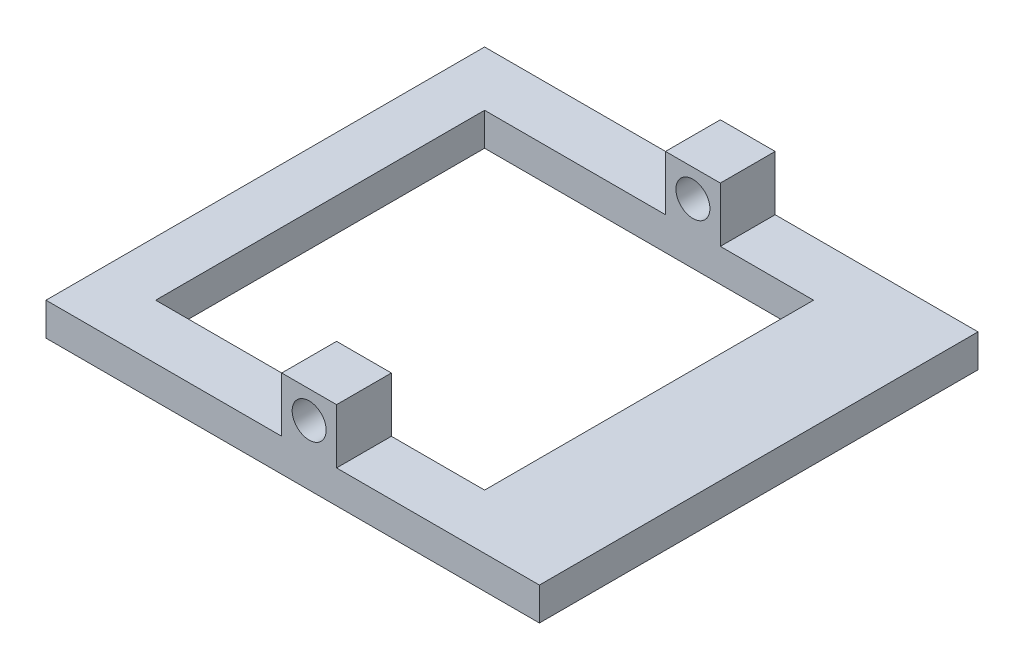
ISO-10303-21;
HEADER;
FILE_DESCRIPTION(('STEP AP214'),'2;1');
FILE_NAME('part.step','',(''),(''),'','','');
FILE_SCHEMA(('AUTOMOTIVE_DESIGN { 1 0 10303 214 1 1 1 1 }'));
ENDSEC;
DATA;
#1=APPLICATION_CONTEXT('core data for automotive mechanical design processes');
#2=APPLICATION_PROTOCOL_DEFINITION('international standard','automotive_design',2000,#1);
#3=PRODUCT_CONTEXT('',#1,'mechanical');
#4=PRODUCT('Part','Part','',(#3));
#5=PRODUCT_RELATED_PRODUCT_CATEGORY('part','',(#4));
#6=PRODUCT_DEFINITION_FORMATION('','',#4);
#7=PRODUCT_DEFINITION_CONTEXT('part definition',#1,'design');
#8=PRODUCT_DEFINITION('design','',#6,#7);
#9=PRODUCT_DEFINITION_SHAPE('','',#8);
#10=(LENGTH_UNIT() NAMED_UNIT(*) SI_UNIT(.MILLI.,.METRE.));
#11=(NAMED_UNIT(*) PLANE_ANGLE_UNIT() SI_UNIT($,.RADIAN.));
#12=(NAMED_UNIT(*) SI_UNIT($,.STERADIAN.) SOLID_ANGLE_UNIT());
#13=UNCERTAINTY_MEASURE_WITH_UNIT(LENGTH_MEASURE(1.E-05),#10,'distance_accuracy_value','');
#14=(GEOMETRIC_REPRESENTATION_CONTEXT(3) GLOBAL_UNCERTAINTY_ASSIGNED_CONTEXT((#13)) GLOBAL_UNIT_ASSIGNED_CONTEXT((#10,
#11,#12)) REPRESENTATION_CONTEXT('',''));
#15=CARTESIAN_POINT('',(0.,0.,0.));
#16=DIRECTION('',(0.,0.,1.));
#17=DIRECTION('',(1.,0.,0.));
#18=AXIS2_PLACEMENT_3D('',#15,#16,#17);
#19=CARTESIAN_POINT('',(0.,3.,0.));
#20=DIRECTION('',(0.,1.,0.));
#21=DIRECTION('',(0.,0.,1.));
#22=AXIS2_PLACEMENT_3D('',#19,#20,#21);
#23=PLANE('',#22);
#24=DIRECTION('',(-1.,0.,0.));
#25=VECTOR('',#24,1.);
#26=CARTESIAN_POINT('',(-22.5,3.,-20.));
#27=LINE('',#26,#25);
#28=CARTESIAN_POINT('',(22.5,3.,-20.));
#29=VERTEX_POINT('',#28);
#30=CARTESIAN_POINT('',(4.,3.,-20.));
#31=VERTEX_POINT('',#30);
#32=EDGE_CURVE('E174',#29,#31,#27,.T.);
#33=ORIENTED_EDGE('',*,*,#32,.T.);
#34=DIRECTION('',(0.,0.,-1.));
#35=VECTOR('',#34,1.);
#36=CARTESIAN_POINT('',(4.,3.,-15.));
#37=LINE('',#36,#35);
#38=CARTESIAN_POINT('',(4.,3.,-15.));
#39=VERTEX_POINT('',#38);
#40=EDGE_CURVE('E159',#39,#31,#37,.T.);
#41=ORIENTED_EDGE('',*,*,#40,.F.);
#42=DIRECTION('',(-1.,0.,0.));
#43=VECTOR('',#42,1.);
#44=CARTESIAN_POINT('',(-17.5,3.,-15.));
#45=LINE('',#44,#43);
#46=CARTESIAN_POINT('',(12.5,3.,-15.));
#47=VERTEX_POINT('',#46);
#48=EDGE_CURVE('E172',#47,#39,#45,.T.);
#49=ORIENTED_EDGE('',*,*,#48,.F.);
#50=DIRECTION('',(0.,0.,-1.));
#51=VECTOR('',#50,1.);
#52=CARTESIAN_POINT('',(12.5,3.,-15.));
#53=LINE('',#52,#51);
#54=CARTESIAN_POINT('',(12.5,3.,15.));
#55=VERTEX_POINT('',#54);
#56=EDGE_CURVE('E188',#55,#47,#53,.T.);
#57=ORIENTED_EDGE('',*,*,#56,.F.);
#58=DIRECTION('',(1.,0.,0.));
#59=VECTOR('',#58,1.);
#60=CARTESIAN_POINT('',(-17.5,3.,15.));
#61=LINE('',#60,#59);
#62=CARTESIAN_POINT('',(4.,3.,15.));
#63=VERTEX_POINT('',#62);
#64=EDGE_CURVE('E186',#63,#55,#61,.T.);
#65=ORIENTED_EDGE('',*,*,#64,.F.);
#66=DIRECTION('',(0.,0.,1.));
#67=VECTOR('',#66,1.);
#68=CARTESIAN_POINT('',(4.,3.,15.));
#69=LINE('',#68,#67);
#70=CARTESIAN_POINT('',(4.,3.,20.));
#71=VERTEX_POINT('',#70);
#72=EDGE_CURVE('E256',#63,#71,#69,.T.);
#73=ORIENTED_EDGE('',*,*,#72,.T.);
#74=DIRECTION('',(1.,0.,0.));
#75=VECTOR('',#74,1.);
#76=CARTESIAN_POINT('',(-22.5,3.,20.));
#77=LINE('',#76,#75);
#78=CARTESIAN_POINT('',(22.5,3.,20.));
#79=VERTEX_POINT('',#78);
#80=EDGE_CURVE('E216',#71,#79,#77,.T.);
#81=ORIENTED_EDGE('',*,*,#80,.T.);
#82=DIRECTION('',(0.,0.,-1.));
#83=VECTOR('',#82,1.);
#84=CARTESIAN_POINT('',(22.5,3.,-20.));
#85=LINE('',#84,#83);
#86=EDGE_CURVE('E209',#79,#29,#85,.T.);
#87=ORIENTED_EDGE('',*,*,#86,.T.);
#88=EDGE_LOOP('',(#33,#41,#49,#57,#65,#73,#81,#87));
#89=FACE_BOUND('',#88,.T.);
#90=ADVANCED_FACE('F35',(#89),#23,.T.);
#91=CARTESIAN_POINT('',(-0.999999999999994,3.,-15.));
#92=VERTEX_POINT('',#91);
#93=CARTESIAN_POINT('',(-17.5,3.,-15.));
#94=VERTEX_POINT('',#93);
#95=EDGE_CURVE('E183',#92,#94,#45,.T.);
#96=ORIENTED_EDGE('',*,*,#95,.F.);
#97=DIRECTION('',(0.,0.,-1.));
#98=VECTOR('',#97,1.);
#99=CARTESIAN_POINT('',(-0.999999999999996,3.,-15.));
#100=LINE('',#99,#98);
#101=CARTESIAN_POINT('',(-0.999999999999996,3.,-20.));
#102=VERTEX_POINT('',#101);
#103=EDGE_CURVE('E50',#92,#102,#100,.T.);
#104=ORIENTED_EDGE('',*,*,#103,.T.);
#105=CARTESIAN_POINT('',(-22.5,3.,-20.));
#106=VERTEX_POINT('',#105);
#107=EDGE_CURVE('E211',#102,#106,#27,.T.);
#108=ORIENTED_EDGE('',*,*,#107,.T.);
#109=DIRECTION('',(0.,0.,1.));
#110=VECTOR('',#109,1.);
#111=CARTESIAN_POINT('',(-22.5,3.,-20.));
#112=LINE('',#111,#110);
#113=CARTESIAN_POINT('',(-22.5,3.,20.));
#114=VERTEX_POINT('',#113);
#115=EDGE_CURVE('E214',#106,#114,#112,.T.);
#116=ORIENTED_EDGE('',*,*,#115,.T.);
#117=CARTESIAN_POINT('',(-0.999999999999996,3.,20.));
#118=VERTEX_POINT('',#117);
#119=EDGE_CURVE('E217',#114,#118,#77,.T.);
#120=ORIENTED_EDGE('',*,*,#119,.T.);
#121=DIRECTION('',(0.,0.,1.));
#122=VECTOR('',#121,1.);
#123=CARTESIAN_POINT('',(-0.999999999999996,3.,15.));
#124=LINE('',#123,#122);
#125=CARTESIAN_POINT('',(-0.999999999999996,3.,15.));
#126=VERTEX_POINT('',#125);
#127=EDGE_CURVE('E275',#126,#118,#124,.T.);
#128=ORIENTED_EDGE('',*,*,#127,.F.);
#129=CARTESIAN_POINT('',(-17.5,3.,15.));
#130=VERTEX_POINT('',#129);
#131=EDGE_CURVE('E192',#130,#126,#61,.T.);
#132=ORIENTED_EDGE('',*,*,#131,.F.);
#133=DIRECTION('',(0.,0.,1.));
#134=VECTOR('',#133,1.);
#135=CARTESIAN_POINT('',(-17.5,3.,-15.));
#136=LINE('',#135,#134);
#137=EDGE_CURVE('E182',#94,#130,#136,.T.);
#138=ORIENTED_EDGE('',*,*,#137,.F.);
#139=EDGE_LOOP('',(#96,#104,#108,#116,#120,#128,#132,#138));
#140=FACE_BOUND('',#139,.T.);
#141=ADVANCED_FACE('F317',(#140),#23,.T.);
#142=CARTESIAN_POINT('',(0.,0.,0.));
#143=DIRECTION('',(0.,1.,0.));
#144=DIRECTION('',(0.,0.,1.));
#145=AXIS2_PLACEMENT_3D('',#142,#143,#144);
#146=PLANE('',#145);
#147=DIRECTION('',(0.,0.,-1.));
#148=VECTOR('',#147,1.);
#149=CARTESIAN_POINT('',(22.5,0.,-20.));
#150=LINE('',#149,#148);
#151=CARTESIAN_POINT('',(22.5,0.,20.));
#152=VERTEX_POINT('',#151);
#153=CARTESIAN_POINT('',(22.5,0.,-20.));
#154=VERTEX_POINT('',#153);
#155=EDGE_CURVE('E208',#152,#154,#150,.T.);
#156=ORIENTED_EDGE('',*,*,#155,.F.);
#157=DIRECTION('',(1.,0.,0.));
#158=VECTOR('',#157,1.);
#159=CARTESIAN_POINT('',(-22.5,0.,20.));
#160=LINE('',#159,#158);
#161=CARTESIAN_POINT('',(-22.5,0.,20.));
#162=VERTEX_POINT('',#161);
#163=EDGE_CURVE('E212',#162,#152,#160,.T.);
#164=ORIENTED_EDGE('',*,*,#163,.F.);
#165=DIRECTION('',(0.,0.,1.));
#166=VECTOR('',#165,1.);
#167=CARTESIAN_POINT('',(-22.5,0.,-20.));
#168=LINE('',#167,#166);
#169=CARTESIAN_POINT('',(-22.5,0.,-20.));
#170=VERTEX_POINT('',#169);
#171=EDGE_CURVE('E225',#170,#162,#168,.T.);
#172=ORIENTED_EDGE('',*,*,#171,.F.);
#173=DIRECTION('',(-1.,0.,0.));
#174=VECTOR('',#173,1.);
#175=CARTESIAN_POINT('',(-22.5,0.,-20.));
#176=LINE('',#175,#174);
#177=EDGE_CURVE('E223',#154,#170,#176,.T.);
#178=ORIENTED_EDGE('',*,*,#177,.F.);
#179=EDGE_LOOP('',(#156,#164,#172,#178));
#180=FACE_BOUND('',#179,.T.);
#181=DIRECTION('',(1.,0.,0.));
#182=VECTOR('',#181,1.);
#183=CARTESIAN_POINT('',(-17.5,0.,15.));
#184=LINE('',#183,#182);
#185=CARTESIAN_POINT('',(-17.5,0.,15.));
#186=VERTEX_POINT('',#185);
#187=CARTESIAN_POINT('',(15.5,0.,15.));
#188=VERTEX_POINT('',#187);
#189=EDGE_CURVE('E203',#186,#188,#184,.T.);
#190=ORIENTED_EDGE('',*,*,#189,.T.);
#191=DIRECTION('',(0.,0.,-1.));
#192=VECTOR('',#191,1.);
#193=CARTESIAN_POINT('',(15.5,0.,15.));
#194=LINE('',#193,#192);
#195=CARTESIAN_POINT('',(15.5,0.,-15.));
#196=VERTEX_POINT('',#195);
#197=EDGE_CURVE('E200',#188,#196,#194,.T.);
#198=ORIENTED_EDGE('',*,*,#197,.T.);
#199=DIRECTION('',(-1.,0.,0.));
#200=VECTOR('',#199,1.);
#201=CARTESIAN_POINT('',(-17.5,0.,-15.));
#202=LINE('',#201,#200);
#203=CARTESIAN_POINT('',(-17.5,0.,-15.));
#204=VERTEX_POINT('',#203);
#205=EDGE_CURVE('E196',#196,#204,#202,.T.);
#206=ORIENTED_EDGE('',*,*,#205,.T.);
#207=DIRECTION('',(0.,0.,1.));
#208=VECTOR('',#207,1.);
#209=CARTESIAN_POINT('',(-17.5,0.,-15.));
#210=LINE('',#209,#208);
#211=EDGE_CURVE('E199',#204,#186,#210,.T.);
#212=ORIENTED_EDGE('',*,*,#211,.T.);
#213=EDGE_LOOP('',(#190,#198,#206,#212));
#214=FACE_BOUND('',#213,.T.);
#215=ADVANCED_FACE('F244',(#180,#214),#146,.F.);
#216=CARTESIAN_POINT('',(22.5,3.,-20.));
#217=DIRECTION('',(-1.,0.,0.));
#218=DIRECTION('',(0.,0.,1.));
#219=AXIS2_PLACEMENT_3D('',#216,#217,#218);
#220=PLANE('',#219);
#221=ORIENTED_EDGE('',*,*,#155,.T.);
#222=DIRECTION('',(0.,-1.,0.));
#223=VECTOR('',#222,1.);
#224=CARTESIAN_POINT('',(22.5,3.,-20.));
#225=LINE('',#224,#223);
#226=EDGE_CURVE('E11',#29,#154,#225,.T.);
#227=ORIENTED_EDGE('',*,*,#226,.F.);
#228=ORIENTED_EDGE('',*,*,#86,.F.);
#229=DIRECTION('',(0.,-1.,0.));
#230=VECTOR('',#229,1.);
#231=CARTESIAN_POINT('',(22.5,3.,20.));
#232=LINE('',#231,#230);
#233=EDGE_CURVE('E220',#79,#152,#232,.T.);
#234=ORIENTED_EDGE('',*,*,#233,.T.);
#235=EDGE_LOOP('',(#221,#227,#228,#234));
#236=FACE_BOUND('',#235,.T.);
#237=ADVANCED_FACE('F37',(#236),#220,.F.);
#238=CARTESIAN_POINT('',(-22.5,3.,-20.));
#239=DIRECTION('',(0.,0.,1.));
#240=DIRECTION('',(1.,0.,0.));
#241=AXIS2_PLACEMENT_3D('',#238,#239,#240);
#242=PLANE('',#241);
#243=ORIENTED_EDGE('',*,*,#177,.T.);
#244=DIRECTION('',(0.,-1.,0.));
#245=VECTOR('',#244,1.);
#246=CARTESIAN_POINT('',(-22.5,3.,-20.));
#247=LINE('',#246,#245);
#248=EDGE_CURVE('E43',#106,#170,#247,.T.);
#249=ORIENTED_EDGE('',*,*,#248,.F.);
#250=ORIENTED_EDGE('',*,*,#107,.F.);
#251=DIRECTION('',(0.,-1.,0.));
#252=VECTOR('',#251,1.);
#253=CARTESIAN_POINT('',(-0.999999999999997,8.,-20.));
#254=LINE('',#253,#252);
#255=CARTESIAN_POINT('',(-0.999999999999997,8.,-20.));
#256=VERTEX_POINT('',#255);
#257=EDGE_CURVE('E350',#256,#102,#254,.T.);
#258=ORIENTED_EDGE('',*,*,#257,.F.);
#259=DIRECTION('',(-1.,0.,0.));
#260=VECTOR('',#259,1.);
#261=CARTESIAN_POINT('',(-0.999999999999997,8.,-20.));
#262=LINE('',#261,#260);
#263=CARTESIAN_POINT('',(4.,8.,-20.));
#264=VERTEX_POINT('',#263);
#265=EDGE_CURVE('E166',#264,#256,#262,.T.);
#266=ORIENTED_EDGE('',*,*,#265,.F.);
#267=DIRECTION('',(0.,1.,0.));
#268=VECTOR('',#267,1.);
#269=CARTESIAN_POINT('',(4.,8.,-20.));
#270=LINE('',#269,#268);
#271=EDGE_CURVE('E344',#31,#264,#270,.T.);
#272=ORIENTED_EDGE('',*,*,#271,.F.);
#273=ORIENTED_EDGE('',*,*,#32,.F.);
#274=ORIENTED_EDGE('',*,*,#226,.T.);
#275=EDGE_LOOP('',(#243,#249,#250,#258,#266,#272,#273,#274));
#276=FACE_BOUND('',#275,.T.);
#277=CARTESIAN_POINT('',(1.5,5.5,-20.));
#278=DIRECTION('',(0.,0.,1.));
#279=DIRECTION('',(1.,0.,0.));
#280=AXIS2_PLACEMENT_3D('',#277,#278,#279);
#281=CIRCLE('',#280,1.55);
#282=CARTESIAN_POINT('',(3.05,5.5,-20.));
#283=VERTEX_POINT('',#282);
#284=EDGE_CURVE('E339',#283,#283,#281,.T.);
#285=ORIENTED_EDGE('',*,*,#284,.T.);
#286=EDGE_LOOP('',(#285));
#287=FACE_BOUND('',#286,.T.);
#288=ADVANCED_FACE('F331',(#276,#287),#242,.F.);
#289=CARTESIAN_POINT('',(-22.5,3.,-20.));
#290=DIRECTION('',(1.,0.,0.));
#291=DIRECTION('',(0.,0.,-1.));
#292=AXIS2_PLACEMENT_3D('',#289,#290,#291);
#293=PLANE('',#292);
#294=ORIENTED_EDGE('',*,*,#171,.T.);
#295=DIRECTION('',(0.,-1.,0.));
#296=VECTOR('',#295,1.);
#297=CARTESIAN_POINT('',(-22.5,3.,20.));
#298=LINE('',#297,#296);
#299=EDGE_CURVE('E230',#114,#162,#298,.T.);
#300=ORIENTED_EDGE('',*,*,#299,.F.);
#301=ORIENTED_EDGE('',*,*,#115,.F.);
#302=ORIENTED_EDGE('',*,*,#248,.T.);
#303=EDGE_LOOP('',(#294,#300,#301,#302));
#304=FACE_BOUND('',#303,.T.);
#305=ADVANCED_FACE('F237',(#304),#293,.F.);
#306=CARTESIAN_POINT('',(-22.5,3.,20.));
#307=DIRECTION('',(0.,0.,-1.));
#308=DIRECTION('',(-1.,0.,0.));
#309=AXIS2_PLACEMENT_3D('',#306,#307,#308);
#310=PLANE('',#309);
#311=ORIENTED_EDGE('',*,*,#163,.T.);
#312=ORIENTED_EDGE('',*,*,#233,.F.);
#313=ORIENTED_EDGE('',*,*,#80,.F.);
#314=DIRECTION('',(0.,1.,0.));
#315=VECTOR('',#314,1.);
#316=CARTESIAN_POINT('',(4.,8.,20.));
#317=LINE('',#316,#315);
#318=CARTESIAN_POINT('',(4.,8.,20.));
#319=VERTEX_POINT('',#318);
#320=EDGE_CURVE('E58',#71,#319,#317,.T.);
#321=ORIENTED_EDGE('',*,*,#320,.T.);
#322=DIRECTION('',(-1.,0.,0.));
#323=VECTOR('',#322,1.);
#324=CARTESIAN_POINT('',(-0.999999999999997,8.,20.));
#325=LINE('',#324,#323);
#326=CARTESIAN_POINT('',(-0.999999999999997,8.,20.));
#327=VERTEX_POINT('',#326);
#328=EDGE_CURVE('E260',#319,#327,#325,.T.);
#329=ORIENTED_EDGE('',*,*,#328,.T.);
#330=DIRECTION('',(0.,-1.,0.));
#331=VECTOR('',#330,1.);
#332=CARTESIAN_POINT('',(-0.999999999999997,8.,20.));
#333=LINE('',#332,#331);
#334=EDGE_CURVE('E263',#327,#118,#333,.T.);
#335=ORIENTED_EDGE('',*,*,#334,.T.);
#336=ORIENTED_EDGE('',*,*,#119,.F.);
#337=ORIENTED_EDGE('',*,*,#299,.T.);
#338=EDGE_LOOP('',(#311,#312,#313,#321,#329,#335,#336,#337));
#339=FACE_BOUND('',#338,.T.);
#340=CARTESIAN_POINT('',(1.5,5.5,20.));
#341=DIRECTION('',(0.,0.,1.));
#342=DIRECTION('',(1.,0.,0.));
#343=AXIS2_PLACEMENT_3D('',#340,#341,#342);
#344=CIRCLE('',#343,1.55);
#345=CARTESIAN_POINT('',(3.05,5.5,20.));
#346=VERTEX_POINT('',#345);
#347=EDGE_CURVE('E266',#346,#346,#344,.T.);
#348=ORIENTED_EDGE('',*,*,#347,.F.);
#349=EDGE_LOOP('',(#348));
#350=FACE_BOUND('',#349,.T.);
#351=ADVANCED_FACE('F248',(#339,#350),#310,.F.);
#352=CARTESIAN_POINT('',(-17.5,3.,-15.));
#353=DIRECTION('',(0.,0.,1.));
#354=DIRECTION('',(1.,0.,0.));
#355=AXIS2_PLACEMENT_3D('',#352,#353,#354);
#356=PLANE('',#355);
#357=ORIENTED_EDGE('',*,*,#205,.F.);
#358=DIRECTION('',(0.,1.,0.));
#359=VECTOR('',#358,1.);
#360=CARTESIAN_POINT('',(15.5,0.,-15.));
#361=LINE('',#360,#359);
#362=CARTESIAN_POINT('',(15.5,2.19615242270662,-15.));
#363=VERTEX_POINT('',#362);
#364=EDGE_CURVE('E285',#196,#363,#361,.T.);
#365=ORIENTED_EDGE('',*,*,#364,.T.);
#366=DIRECTION('',(-0.965925826289067,0.258819045102525,0.));
#367=VECTOR('',#366,1.);
#368=CARTESIAN_POINT('',(15.5,2.19615242270662,-15.));
#369=LINE('',#368,#367);
#370=EDGE_CURVE('E181',#363,#47,#369,.T.);
#371=ORIENTED_EDGE('',*,*,#370,.T.);
#372=ORIENTED_EDGE('',*,*,#48,.T.);
#373=DIRECTION('',(0.,1.,0.));
#374=VECTOR('',#373,1.);
#375=CARTESIAN_POINT('',(4.,8.,-15.));
#376=LINE('',#375,#374);
#377=CARTESIAN_POINT('',(4.,8.,-15.));
#378=VERTEX_POINT('',#377);
#379=EDGE_CURVE('E155',#39,#378,#376,.T.);
#380=ORIENTED_EDGE('',*,*,#379,.T.);
#381=DIRECTION('',(-1.,0.,0.));
#382=VECTOR('',#381,1.);
#383=CARTESIAN_POINT('',(-0.999999999999997,8.,-15.));
#384=LINE('',#383,#382);
#385=CARTESIAN_POINT('',(-0.999999999999997,8.,-15.));
#386=VERTEX_POINT('',#385);
#387=EDGE_CURVE('E175',#378,#386,#384,.T.);
#388=ORIENTED_EDGE('',*,*,#387,.T.);
#389=DIRECTION('',(0.,-1.,0.));
#390=VECTOR('',#389,1.);
#391=CARTESIAN_POINT('',(-0.999999999999997,8.,-15.));
#392=LINE('',#391,#390);
#393=EDGE_CURVE('E165',#386,#92,#392,.T.);
#394=ORIENTED_EDGE('',*,*,#393,.T.);
#395=ORIENTED_EDGE('',*,*,#95,.T.);
#396=DIRECTION('',(0.,-1.,0.));
#397=VECTOR('',#396,1.);
#398=CARTESIAN_POINT('',(-17.5,3.,-15.));
#399=LINE('',#398,#397);
#400=EDGE_CURVE('E206',#94,#204,#399,.T.);
#401=ORIENTED_EDGE('',*,*,#400,.T.);
#402=EDGE_LOOP('',(#357,#365,#371,#372,#380,#388,#394,#395,#401));
#403=FACE_BOUND('',#402,.T.);
#404=CARTESIAN_POINT('',(1.5,5.5,-15.));
#405=DIRECTION('',(0.,0.,1.));
#406=DIRECTION('',(1.,0.,0.));
#407=AXIS2_PLACEMENT_3D('',#404,#405,#406);
#408=CIRCLE('',#407,1.55);
#409=CARTESIAN_POINT('',(3.05,5.5,-15.));
#410=VERTEX_POINT('',#409);
#411=EDGE_CURVE('E341',#410,#410,#408,.T.);
#412=ORIENTED_EDGE('',*,*,#411,.F.);
#413=EDGE_LOOP('',(#412));
#414=FACE_BOUND('',#413,.T.);
#415=ADVANCED_FACE('F178',(#403,#414),#356,.T.);
#416=CARTESIAN_POINT('',(-17.5,3.,-15.));
#417=DIRECTION('',(1.,0.,0.));
#418=DIRECTION('',(0.,0.,-1.));
#419=AXIS2_PLACEMENT_3D('',#416,#417,#418);
#420=PLANE('',#419);
#421=ORIENTED_EDGE('',*,*,#211,.F.);
#422=ORIENTED_EDGE('',*,*,#400,.F.);
#423=ORIENTED_EDGE('',*,*,#137,.T.);
#424=DIRECTION('',(0.,-1.,0.));
#425=VECTOR('',#424,1.);
#426=CARTESIAN_POINT('',(-17.5,3.,15.));
#427=LINE('',#426,#425);
#428=EDGE_CURVE('E195',#130,#186,#427,.T.);
#429=ORIENTED_EDGE('',*,*,#428,.T.);
#430=EDGE_LOOP('',(#421,#422,#423,#429));
#431=FACE_BOUND('',#430,.T.);
#432=ADVANCED_FACE('F314',(#431),#420,.T.);
#433=CARTESIAN_POINT('',(-17.5,3.,15.));
#434=DIRECTION('',(0.,0.,-1.));
#435=DIRECTION('',(-1.,0.,0.));
#436=AXIS2_PLACEMENT_3D('',#433,#434,#435);
#437=PLANE('',#436);
#438=ORIENTED_EDGE('',*,*,#189,.F.);
#439=ORIENTED_EDGE('',*,*,#428,.F.);
#440=ORIENTED_EDGE('',*,*,#131,.T.);
#441=DIRECTION('',(0.,-1.,0.));
#442=VECTOR('',#441,1.);
#443=CARTESIAN_POINT('',(-0.999999999999997,8.,15.));
#444=LINE('',#443,#442);
#445=CARTESIAN_POINT('',(-0.999999999999997,8.,15.));
#446=VERTEX_POINT('',#445);
#447=EDGE_CURVE('E269',#446,#126,#444,.T.);
#448=ORIENTED_EDGE('',*,*,#447,.F.);
#449=DIRECTION('',(-1.,0.,0.));
#450=VECTOR('',#449,1.);
#451=CARTESIAN_POINT('',(-0.999999999999997,8.,15.));
#452=LINE('',#451,#450);
#453=CARTESIAN_POINT('',(4.,8.,15.));
#454=VERTEX_POINT('',#453);
#455=EDGE_CURVE('E361',#454,#446,#452,.T.);
#456=ORIENTED_EDGE('',*,*,#455,.F.);
#457=DIRECTION('',(0.,1.,0.));
#458=VECTOR('',#457,1.);
#459=CARTESIAN_POINT('',(4.,8.,15.));
#460=LINE('',#459,#458);
#461=EDGE_CURVE('E273',#63,#454,#460,.T.);
#462=ORIENTED_EDGE('',*,*,#461,.F.);
#463=ORIENTED_EDGE('',*,*,#64,.T.);
#464=DIRECTION('',(-0.965925826289067,0.258819045102525,0.));
#465=VECTOR('',#464,1.);
#466=CARTESIAN_POINT('',(15.5,2.19615242270662,15.));
#467=LINE('',#466,#465);
#468=CARTESIAN_POINT('',(15.5,2.19615242270662,15.));
#469=VERTEX_POINT('',#468);
#470=EDGE_CURVE('E281',#469,#55,#467,.T.);
#471=ORIENTED_EDGE('',*,*,#470,.F.);
#472=DIRECTION('',(0.,1.,0.));
#473=VECTOR('',#472,1.);
#474=CARTESIAN_POINT('',(15.5,0.,15.));
#475=LINE('',#474,#473);
#476=EDGE_CURVE('E284',#188,#469,#475,.T.);
#477=ORIENTED_EDGE('',*,*,#476,.F.);
#478=EDGE_LOOP('',(#438,#439,#440,#448,#456,#462,#463,#471,#477));
#479=FACE_BOUND('',#478,.T.);
#480=CARTESIAN_POINT('',(1.5,5.5,15.));
#481=DIRECTION('',(0.,0.,1.));
#482=DIRECTION('',(1.,0.,0.));
#483=AXIS2_PLACEMENT_3D('',#480,#481,#482);
#484=CIRCLE('',#483,1.55);
#485=CARTESIAN_POINT('',(3.05,5.5,15.));
#486=VERTEX_POINT('',#485);
#487=EDGE_CURVE('E261',#486,#486,#484,.T.);
#488=ORIENTED_EDGE('',*,*,#487,.T.);
#489=EDGE_LOOP('',(#488));
#490=FACE_BOUND('',#489,.T.);
#491=ADVANCED_FACE('F301',(#479,#490),#437,.T.);
#492=CARTESIAN_POINT('',(15.5,2.19615242270662,15.));
#493=DIRECTION('',(-0.258819045102525,-0.965925826289067,0.));
#494=DIRECTION('',(0.965925826289067,-0.258819045102525,0.));
#495=AXIS2_PLACEMENT_3D('',#492,#493,#494);
#496=PLANE('',#495);
#497=ORIENTED_EDGE('',*,*,#370,.F.);
#498=DIRECTION('',(0.,0.,-1.));
#499=VECTOR('',#498,1.);
#500=CARTESIAN_POINT('',(15.5,2.19615242270662,15.));
#501=LINE('',#500,#499);
#502=EDGE_CURVE('E287',#469,#363,#501,.T.);
#503=ORIENTED_EDGE('',*,*,#502,.F.);
#504=ORIENTED_EDGE('',*,*,#470,.T.);
#505=ORIENTED_EDGE('',*,*,#56,.T.);
#506=EDGE_LOOP('',(#497,#503,#504,#505));
#507=FACE_BOUND('',#506,.T.);
#508=ADVANCED_FACE('F305',(#507),#496,.T.);
#509=CARTESIAN_POINT('',(15.5,0.,15.));
#510=DIRECTION('',(-1.,0.,0.));
#511=DIRECTION('',(0.,0.,1.));
#512=AXIS2_PLACEMENT_3D('',#509,#510,#511);
#513=PLANE('',#512);
#514=ORIENTED_EDGE('',*,*,#364,.F.);
#515=ORIENTED_EDGE('',*,*,#197,.F.);
#516=ORIENTED_EDGE('',*,*,#476,.T.);
#517=ORIENTED_EDGE('',*,*,#502,.T.);
#518=EDGE_LOOP('',(#514,#515,#516,#517));
#519=FACE_BOUND('',#518,.T.);
#520=ADVANCED_FACE('F297',(#519),#513,.T.);
#521=CARTESIAN_POINT('',(4.,8.,15.));
#522=DIRECTION('',(1.,0.,0.));
#523=DIRECTION('',(0.,1.,0.));
#524=AXIS2_PLACEMENT_3D('',#521,#522,#523);
#525=PLANE('',#524);
#526=ORIENTED_EDGE('',*,*,#320,.F.);
#527=ORIENTED_EDGE('',*,*,#72,.F.);
#528=ORIENTED_EDGE('',*,*,#461,.T.);
#529=DIRECTION('',(0.,0.,1.));
#530=VECTOR('',#529,1.);
#531=CARTESIAN_POINT('',(4.,8.,15.));
#532=LINE('',#531,#530);
#533=EDGE_CURVE('E279',#454,#319,#532,.T.);
#534=ORIENTED_EDGE('',*,*,#533,.T.);
#535=EDGE_LOOP('',(#526,#527,#528,#534));
#536=FACE_BOUND('',#535,.T.);
#537=ADVANCED_FACE('F312',(#536),#525,.T.);
#538=CARTESIAN_POINT('',(-0.999999999999997,8.,15.));
#539=DIRECTION('',(-1.,0.,0.));
#540=DIRECTION('',(0.,-1.,0.));
#541=AXIS2_PLACEMENT_3D('',#538,#539,#540);
#542=PLANE('',#541);
#543=ORIENTED_EDGE('',*,*,#334,.F.);
#544=DIRECTION('',(0.,0.,1.));
#545=VECTOR('',#544,1.);
#546=CARTESIAN_POINT('',(-0.999999999999997,8.,15.));
#547=LINE('',#546,#545);
#548=EDGE_CURVE('E277',#446,#327,#547,.T.);
#549=ORIENTED_EDGE('',*,*,#548,.F.);
#550=ORIENTED_EDGE('',*,*,#447,.T.);
#551=ORIENTED_EDGE('',*,*,#127,.T.);
#552=EDGE_LOOP('',(#543,#549,#550,#551));
#553=FACE_BOUND('',#552,.T.);
#554=ADVANCED_FACE('F369',(#553),#542,.T.);
#555=CARTESIAN_POINT('',(-0.999999999999997,8.,15.));
#556=DIRECTION('',(0.,1.,0.));
#557=DIRECTION('',(-1.,0.,0.));
#558=AXIS2_PLACEMENT_3D('',#555,#556,#557);
#559=PLANE('',#558);
#560=ORIENTED_EDGE('',*,*,#328,.F.);
#561=ORIENTED_EDGE('',*,*,#533,.F.);
#562=ORIENTED_EDGE('',*,*,#455,.T.);
#563=ORIENTED_EDGE('',*,*,#548,.T.);
#564=EDGE_LOOP('',(#560,#561,#562,#563));
#565=FACE_BOUND('',#564,.T.);
#566=ADVANCED_FACE('F395',(#565),#559,.T.);
#567=CARTESIAN_POINT('',(1.5,5.5,15.));
#568=DIRECTION('',(0.,0.,1.));
#569=DIRECTION('',(1.,0.,0.));
#570=AXIS2_PLACEMENT_3D('',#567,#568,#569);
#571=CYLINDRICAL_SURFACE('',#570,1.55);
#572=ORIENTED_EDGE('',*,*,#487,.F.);
#573=EDGE_LOOP('',(#572));
#574=FACE_BOUND('',#573,.T.);
#575=ORIENTED_EDGE('',*,*,#347,.T.);
#576=EDGE_LOOP('',(#575));
#577=FACE_BOUND('',#576,.T.);
#578=ADVANCED_FACE('F389',(#574,#577),#571,.F.);
#579=CARTESIAN_POINT('',(4.,8.,-15.));
#580=DIRECTION('',(-1.,0.,0.));
#581=DIRECTION('',(0.,-1.,0.));
#582=AXIS2_PLACEMENT_3D('',#579,#580,#581);
#583=PLANE('',#582);
#584=ORIENTED_EDGE('',*,*,#271,.T.);
#585=DIRECTION('',(0.,0.,-1.));
#586=VECTOR('',#585,1.);
#587=CARTESIAN_POINT('',(4.,8.,-15.));
#588=LINE('',#587,#586);
#589=EDGE_CURVE('E162',#378,#264,#588,.T.);
#590=ORIENTED_EDGE('',*,*,#589,.F.);
#591=ORIENTED_EDGE('',*,*,#379,.F.);
#592=ORIENTED_EDGE('',*,*,#40,.T.);
#593=EDGE_LOOP('',(#584,#590,#591,#592));
#594=FACE_BOUND('',#593,.T.);
#595=ADVANCED_FACE('F158',(#594),#583,.F.);
#596=CARTESIAN_POINT('',(-0.999999999999997,8.,-15.));
#597=DIRECTION('',(0.,-1.,0.));
#598=DIRECTION('',(1.,0.,0.));
#599=AXIS2_PLACEMENT_3D('',#596,#597,#598);
#600=PLANE('',#599);
#601=ORIENTED_EDGE('',*,*,#265,.T.);
#602=DIRECTION('',(0.,0.,-1.));
#603=VECTOR('',#602,1.);
#604=CARTESIAN_POINT('',(-0.999999999999997,8.,-15.));
#605=LINE('',#604,#603);
#606=EDGE_CURVE('E354',#386,#256,#605,.T.);
#607=ORIENTED_EDGE('',*,*,#606,.F.);
#608=ORIENTED_EDGE('',*,*,#387,.F.);
#609=ORIENTED_EDGE('',*,*,#589,.T.);
#610=EDGE_LOOP('',(#601,#607,#608,#609));
#611=FACE_BOUND('',#610,.T.);
#612=ADVANCED_FACE('F380',(#611),#600,.F.);
#613=CARTESIAN_POINT('',(-0.999999999999997,8.,-15.));
#614=DIRECTION('',(1.,0.,0.));
#615=DIRECTION('',(0.,1.,0.));
#616=AXIS2_PLACEMENT_3D('',#613,#614,#615);
#617=PLANE('',#616);
#618=ORIENTED_EDGE('',*,*,#257,.T.);
#619=ORIENTED_EDGE('',*,*,#103,.F.);
#620=ORIENTED_EDGE('',*,*,#393,.F.);
#621=ORIENTED_EDGE('',*,*,#606,.T.);
#622=EDGE_LOOP('',(#618,#619,#620,#621));
#623=FACE_BOUND('',#622,.T.);
#624=ADVANCED_FACE('F377',(#623),#617,.F.);
#625=CARTESIAN_POINT('',(1.5,5.5,-15.));
#626=DIRECTION('',(0.,0.,-1.));
#627=DIRECTION('',(-1.,0.,0.));
#628=AXIS2_PLACEMENT_3D('',#625,#626,#627);
#629=CYLINDRICAL_SURFACE('',#628,1.55);
#630=ORIENTED_EDGE('',*,*,#411,.T.);
#631=EDGE_LOOP('',(#630));
#632=FACE_BOUND('',#631,.T.);
#633=ORIENTED_EDGE('',*,*,#284,.F.);
#634=EDGE_LOOP('',(#633));
#635=FACE_BOUND('',#634,.T.);
#636=ADVANCED_FACE('F387',(#632,#635),#629,.F.);
#637=CLOSED_SHELL('',(#90,#141,#215,#237,#288,#305,#351,#415,#432,#491,#508,#520,#537,#554,#566,
#578,#595,#612,#624,#636));
#638=MANIFOLD_SOLID_BREP('B2',#637);
#639=ADVANCED_BREP_SHAPE_REPRESENTATION('',(#18,#638),#14);
#640=SHAPE_DEFINITION_REPRESENTATION(#9,#639);
ENDSEC;
END-ISO-10303-21;
